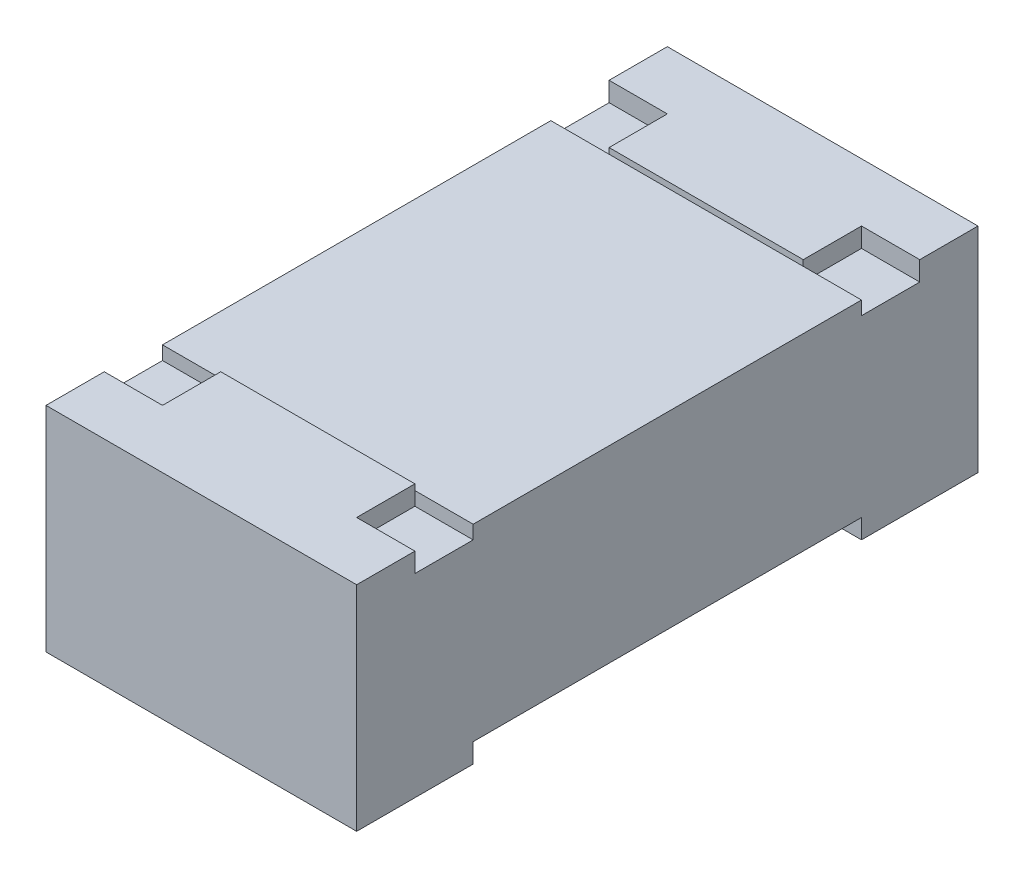
ISO-10303-21;
HEADER;
FILE_DESCRIPTION(('STEP AP214'),'2;1');
FILE_NAME('part.step','',(''),(''),'','','');
FILE_SCHEMA(('AUTOMOTIVE_DESIGN { 1 0 10303 214 1 1 1 1 }'));
ENDSEC;
DATA;
#1=APPLICATION_CONTEXT('core data for automotive mechanical design processes');
#2=APPLICATION_PROTOCOL_DEFINITION('international standard','automotive_design',2000,#1);
#3=PRODUCT_CONTEXT('',#1,'mechanical');
#4=PRODUCT('Part','Part','',(#3));
#5=PRODUCT_RELATED_PRODUCT_CATEGORY('part','',(#4));
#6=PRODUCT_DEFINITION_FORMATION('','',#4);
#7=PRODUCT_DEFINITION_CONTEXT('part definition',#1,'design');
#8=PRODUCT_DEFINITION('design','',#6,#7);
#9=PRODUCT_DEFINITION_SHAPE('','',#8);
#10=(LENGTH_UNIT() NAMED_UNIT(*) SI_UNIT(.MILLI.,.METRE.));
#11=(NAMED_UNIT(*) PLANE_ANGLE_UNIT() SI_UNIT($,.RADIAN.));
#12=(NAMED_UNIT(*) SI_UNIT($,.STERADIAN.) SOLID_ANGLE_UNIT());
#13=UNCERTAINTY_MEASURE_WITH_UNIT(LENGTH_MEASURE(1.E-05),#10,'distance_accuracy_value','');
#14=(GEOMETRIC_REPRESENTATION_CONTEXT(3) GLOBAL_UNCERTAINTY_ASSIGNED_CONTEXT((#13)) GLOBAL_UNIT_ASSIGNED_CONTEXT((#10,
#11,#12)) REPRESENTATION_CONTEXT('',''));
#15=CARTESIAN_POINT('',(0.,0.,0.));
#16=DIRECTION('',(0.,0.,1.));
#17=DIRECTION('',(1.,0.,0.));
#18=AXIS2_PLACEMENT_3D('',#15,#16,#17);
#19=CARTESIAN_POINT('',(-6.58499803303085,1.58166,-14.44));
#20=DIRECTION('',(0.,-1.,0.));
#21=DIRECTION('',(0.,0.,-1.));
#22=AXIS2_PLACEMENT_3D('',#19,#20,#21);
#23=PLANE('',#22);
#24=DIRECTION('',(-1.,0.,0.));
#25=VECTOR('',#24,1.);
#26=CARTESIAN_POINT('',(-6.58499803303084,1.58166,-14.74));
#27=LINE('',#26,#25);
#28=CARTESIAN_POINT('',(-6.58499803303084,1.58166,-14.74));
#29=VERTEX_POINT('',#28);
#30=CARTESIAN_POINT('',(-7.38499803303085,1.58166,-14.74));
#31=VERTEX_POINT('',#30);
#32=EDGE_CURVE('E19',#29,#31,#27,.T.);
#33=ORIENTED_EDGE('',*,*,#32,.F.);
#34=DIRECTION('',(0.,0.,-1.));
#35=VECTOR('',#34,1.);
#36=CARTESIAN_POINT('',(-6.58499803303084,1.58166,-14.74));
#37=LINE('',#36,#35);
#38=CARTESIAN_POINT('',(-6.58499803303085,1.58166,-14.44));
#39=VERTEX_POINT('',#38);
#40=EDGE_CURVE('E295',#39,#29,#37,.T.);
#41=ORIENTED_EDGE('',*,*,#40,.F.);
#42=DIRECTION('',(1.,0.,0.));
#43=VECTOR('',#42,1.);
#44=CARTESIAN_POINT('',(-6.58499803303085,1.58166,-14.44));
#45=LINE('',#44,#43);
#46=CARTESIAN_POINT('',(-7.38499803303085,1.58166,-14.44));
#47=VERTEX_POINT('',#46);
#48=EDGE_CURVE('E305',#47,#39,#45,.T.);
#49=ORIENTED_EDGE('',*,*,#48,.F.);
#50=DIRECTION('',(0.,0.,-1.));
#51=VECTOR('',#50,1.);
#52=CARTESIAN_POINT('',(-7.38499803303085,1.58166,-14.74));
#53=LINE('',#52,#51);
#54=EDGE_CURVE('E231',#47,#31,#53,.T.);
#55=ORIENTED_EDGE('',*,*,#54,.T.);
#56=EDGE_LOOP('',(#33,#41,#49,#55));
#57=FACE_BOUND('',#56,.T.);
#58=ADVANCED_FACE('F16',(#57),#23,.T.);
#59=CARTESIAN_POINT('',(-6.58499803303084,1.58166,-14.74));
#60=DIRECTION('',(0.,0.,-1.));
#61=DIRECTION('',(-1.,0.,0.));
#62=AXIS2_PLACEMENT_3D('',#59,#60,#61);
#63=PLANE('',#62);
#64=DIRECTION('',(1.,0.,0.));
#65=VECTOR('',#64,1.);
#66=CARTESIAN_POINT('',(-6.58499803303084,1.63166,-14.74));
#67=LINE('',#66,#65);
#68=CARTESIAN_POINT('',(-6.58499803303084,1.63166,-14.74));
#69=VERTEX_POINT('',#68);
#70=CARTESIAN_POINT('',(-7.38499803303085,1.63166,-14.74));
#71=VERTEX_POINT('',#70);
#72=EDGE_CURVE('E247',#69,#71,#67,.F.);
#73=ORIENTED_EDGE('',*,*,#72,.F.);
#74=DIRECTION('',(0.,1.,0.));
#75=VECTOR('',#74,1.);
#76=CARTESIAN_POINT('',(-6.58499803303084,1.58166,-14.74));
#77=LINE('',#76,#75);
#78=EDGE_CURVE('E226',#29,#69,#77,.T.);
#79=ORIENTED_EDGE('',*,*,#78,.F.);
#80=ORIENTED_EDGE('',*,*,#32,.T.);
#81=DIRECTION('',(0.,1.,0.));
#82=VECTOR('',#81,1.);
#83=CARTESIAN_POINT('',(-7.38499803303085,1.58166,-14.74));
#84=LINE('',#83,#82);
#85=EDGE_CURVE('E223',#31,#71,#84,.T.);
#86=ORIENTED_EDGE('',*,*,#85,.T.);
#87=EDGE_LOOP('',(#73,#79,#80,#86));
#88=FACE_BOUND('',#87,.T.);
#89=ADVANCED_FACE('F222',(#88),#63,.T.);
#90=CARTESIAN_POINT('',(-6.58499803303084,1.58166,-16.04));
#91=DIRECTION('',(0.,-1.,0.));
#92=DIRECTION('',(0.,0.,-1.));
#93=AXIS2_PLACEMENT_3D('',#90,#91,#92);
#94=PLANE('',#93);
#95=DIRECTION('',(-1.,0.,0.));
#96=VECTOR('',#95,1.);
#97=CARTESIAN_POINT('',(-6.58499803303084,1.58166,-16.04));
#98=LINE('',#97,#96);
#99=CARTESIAN_POINT('',(-6.58499803303084,1.58166,-16.04));
#100=VERTEX_POINT('',#99);
#101=CARTESIAN_POINT('',(-7.38499803303084,1.58166,-16.04));
#102=VERTEX_POINT('',#101);
#103=EDGE_CURVE('E192',#100,#102,#98,.T.);
#104=ORIENTED_EDGE('',*,*,#103,.F.);
#105=DIRECTION('',(0.,0.,1.));
#106=VECTOR('',#105,1.);
#107=CARTESIAN_POINT('',(-6.58499803303084,1.58166,-15.74));
#108=LINE('',#107,#106);
#109=CARTESIAN_POINT('',(-6.58499803303084,1.58166,-15.74));
#110=VERTEX_POINT('',#109);
#111=EDGE_CURVE('E291',#100,#110,#108,.T.);
#112=ORIENTED_EDGE('',*,*,#111,.T.);
#113=DIRECTION('',(1.,0.,0.));
#114=VECTOR('',#113,1.);
#115=CARTESIAN_POINT('',(-6.58499803303084,1.58166,-15.74));
#116=LINE('',#115,#114);
#117=CARTESIAN_POINT('',(-7.38499803303085,1.58166,-15.74));
#118=VERTEX_POINT('',#117);
#119=EDGE_CURVE('E187',#118,#110,#116,.T.);
#120=ORIENTED_EDGE('',*,*,#119,.F.);
#121=DIRECTION('',(0.,0.,1.));
#122=VECTOR('',#121,1.);
#123=CARTESIAN_POINT('',(-7.38499803303085,1.58166,-15.74));
#124=LINE('',#123,#122);
#125=EDGE_CURVE('E203',#102,#118,#124,.T.);
#126=ORIENTED_EDGE('',*,*,#125,.F.);
#127=EDGE_LOOP('',(#104,#112,#120,#126));
#128=FACE_BOUND('',#127,.T.);
#129=ADVANCED_FACE('F204',(#128),#94,.T.);
#130=CARTESIAN_POINT('',(-6.58499803303084,1.58166,-15.74));
#131=DIRECTION('',(0.,0.,1.));
#132=DIRECTION('',(1.,0.,0.));
#133=AXIS2_PLACEMENT_3D('',#130,#131,#132);
#134=PLANE('',#133);
#135=ORIENTED_EDGE('',*,*,#119,.T.);
#136=DIRECTION('',(0.,1.,0.));
#137=VECTOR('',#136,1.);
#138=CARTESIAN_POINT('',(-6.58499803303084,2.08166,-15.74));
#139=LINE('',#138,#137);
#140=CARTESIAN_POINT('',(-6.58499803303084,1.63166,-15.74));
#141=VERTEX_POINT('',#140);
#142=EDGE_CURVE('E289',#110,#141,#139,.T.);
#143=ORIENTED_EDGE('',*,*,#142,.T.);
#144=DIRECTION('',(1.,0.,0.));
#145=VECTOR('',#144,1.);
#146=CARTESIAN_POINT('',(-6.58499803303084,1.63166,-15.74));
#147=LINE('',#146,#145);
#148=CARTESIAN_POINT('',(-7.38499803303085,1.63166,-15.74));
#149=VERTEX_POINT('',#148);
#150=EDGE_CURVE('E245',#149,#141,#147,.T.);
#151=ORIENTED_EDGE('',*,*,#150,.F.);
#152=DIRECTION('',(0.,1.,0.));
#153=VECTOR('',#152,1.);
#154=CARTESIAN_POINT('',(-7.38499803303085,2.08166,-15.74));
#155=LINE('',#154,#153);
#156=EDGE_CURVE('E207',#118,#149,#155,.T.);
#157=ORIENTED_EDGE('',*,*,#156,.F.);
#158=EDGE_LOOP('',(#135,#143,#151,#157));
#159=FACE_BOUND('',#158,.T.);
#160=ADVANCED_FACE('F489',(#159),#134,.T.);
#161=CARTESIAN_POINT('',(-6.58499803303084,2.08166,-15.89));
#162=DIRECTION('',(0.,0.,-1.));
#163=DIRECTION('',(-1.,0.,0.));
#164=AXIS2_PLACEMENT_3D('',#161,#162,#163);
#165=PLANE('',#164);
#166=DIRECTION('',(0.,1.,0.));
#167=VECTOR('',#166,1.);
#168=CARTESIAN_POINT('',(-6.73499803303084,2.08166,-15.89));
#169=LINE('',#168,#167);
#170=CARTESIAN_POINT('',(-6.73499803303084,2.13166,-15.89));
#171=VERTEX_POINT('',#170);
#172=CARTESIAN_POINT('',(-6.73499803303084,2.08166,-15.89));
#173=VERTEX_POINT('',#172);
#174=EDGE_CURVE('E282',#171,#173,#169,.F.);
#175=ORIENTED_EDGE('',*,*,#174,.T.);
#176=DIRECTION('',(1.,0.,0.));
#177=VECTOR('',#176,1.);
#178=CARTESIAN_POINT('',(-6.58499803303084,2.08166,-15.89));
#179=LINE('',#178,#177);
#180=CARTESIAN_POINT('',(-6.58499803303084,2.08166,-15.89));
#181=VERTEX_POINT('',#180);
#182=EDGE_CURVE('E284',#181,#173,#179,.F.);
#183=ORIENTED_EDGE('',*,*,#182,.F.);
#184=DIRECTION('',(0.,1.,0.));
#185=VECTOR('',#184,1.);
#186=CARTESIAN_POINT('',(-6.58499803303084,2.08166,-15.89));
#187=LINE('',#186,#185);
#188=CARTESIAN_POINT('',(-6.58499803303084,2.13166,-15.89));
#189=VERTEX_POINT('',#188);
#190=EDGE_CURVE('E287',#181,#189,#187,.T.);
#191=ORIENTED_EDGE('',*,*,#190,.T.);
#192=DIRECTION('',(1.,0.,0.));
#193=VECTOR('',#192,1.);
#194=CARTESIAN_POINT('',(-6.58499803303084,2.13166,-15.89));
#195=LINE('',#194,#193);
#196=EDGE_CURVE('E274',#171,#189,#195,.T.);
#197=ORIENTED_EDGE('',*,*,#196,.F.);
#198=EDGE_LOOP('',(#175,#183,#191,#197));
#199=FACE_BOUND('',#198,.T.);
#200=ADVANCED_FACE('F491',(#199),#165,.F.);
#201=CARTESIAN_POINT('',(-6.58499803303084,2.13166,-16.04));
#202=DIRECTION('',(0.,0.,-1.));
#203=DIRECTION('',(-1.,0.,0.));
#204=AXIS2_PLACEMENT_3D('',#201,#202,#203);
#205=PLANE('',#204);
#206=DIRECTION('',(1.,0.,0.));
#207=VECTOR('',#206,1.);
#208=CARTESIAN_POINT('',(-6.58499803303084,2.13166,-16.04));
#209=LINE('',#208,#207);
#210=CARTESIAN_POINT('',(-6.58499803303084,2.13166,-16.04));
#211=VERTEX_POINT('',#210);
#212=CARTESIAN_POINT('',(-7.38499803303084,2.13166,-16.04));
#213=VERTEX_POINT('',#212);
#214=EDGE_CURVE('E269',#211,#213,#209,.F.);
#215=ORIENTED_EDGE('',*,*,#214,.F.);
#216=DIRECTION('',(0.,1.,0.));
#217=VECTOR('',#216,1.);
#218=CARTESIAN_POINT('',(-6.58499803303084,2.08166,-16.04));
#219=LINE('',#218,#217);
#220=EDGE_CURVE('E198',#211,#100,#219,.F.);
#221=ORIENTED_EDGE('',*,*,#220,.T.);
#222=ORIENTED_EDGE('',*,*,#103,.T.);
#223=DIRECTION('',(0.,1.,0.));
#224=VECTOR('',#223,1.);
#225=CARTESIAN_POINT('',(-7.38499803303085,2.08166,-16.04));
#226=LINE('',#225,#224);
#227=EDGE_CURVE('E196',#213,#102,#226,.F.);
#228=ORIENTED_EDGE('',*,*,#227,.F.);
#229=EDGE_LOOP('',(#215,#221,#222,#228));
#230=FACE_BOUND('',#229,.T.);
#231=ADVANCED_FACE('F194',(#230),#205,.T.);
#232=CARTESIAN_POINT('',(-7.38499803303084,2.08166,-15.89));
#233=DIRECTION('',(0.,0.,-1.));
#234=DIRECTION('',(-1.,0.,0.));
#235=AXIS2_PLACEMENT_3D('',#232,#233,#234);
#236=PLANE('',#235);
#237=DIRECTION('',(0.,1.,0.));
#238=VECTOR('',#237,1.);
#239=CARTESIAN_POINT('',(-7.38499803303085,2.08166,-15.89));
#240=LINE('',#239,#238);
#241=CARTESIAN_POINT('',(-7.38499803303084,2.08166,-15.89));
#242=VERTEX_POINT('',#241);
#243=CARTESIAN_POINT('',(-7.38499803303084,2.13166,-15.89));
#244=VERTEX_POINT('',#243);
#245=EDGE_CURVE('E200',#242,#244,#240,.T.);
#246=ORIENTED_EDGE('',*,*,#245,.F.);
#247=DIRECTION('',(1.,0.,0.));
#248=VECTOR('',#247,1.);
#249=CARTESIAN_POINT('',(-6.58499803303084,2.08166,-15.89));
#250=LINE('',#249,#248);
#251=CARTESIAN_POINT('',(-7.23499803303084,2.08166,-15.89));
#252=VERTEX_POINT('',#251);
#253=EDGE_CURVE('E249',#252,#242,#250,.F.);
#254=ORIENTED_EDGE('',*,*,#253,.F.);
#255=DIRECTION('',(0.,1.,0.));
#256=VECTOR('',#255,1.);
#257=CARTESIAN_POINT('',(-7.23499803303084,2.08166,-15.89));
#258=LINE('',#257,#256);
#259=CARTESIAN_POINT('',(-7.23499803303084,2.13166,-15.89));
#260=VERTEX_POINT('',#259);
#261=EDGE_CURVE('E263',#252,#260,#258,.T.);
#262=ORIENTED_EDGE('',*,*,#261,.T.);
#263=DIRECTION('',(1.,0.,0.));
#264=VECTOR('',#263,1.);
#265=CARTESIAN_POINT('',(-6.58499803303084,2.13166,-15.89));
#266=LINE('',#265,#264);
#267=EDGE_CURVE('E265',#244,#260,#266,.T.);
#268=ORIENTED_EDGE('',*,*,#267,.F.);
#269=EDGE_LOOP('',(#246,#254,#262,#268));
#270=FACE_BOUND('',#269,.T.);
#271=ADVANCED_FACE('F483',(#270),#236,.F.);
#272=CARTESIAN_POINT('',(-7.38499803303085,2.08166,-14.59));
#273=DIRECTION('',(0.,0.,1.));
#274=DIRECTION('',(1.,0.,0.));
#275=AXIS2_PLACEMENT_3D('',#272,#273,#274);
#276=PLANE('',#275);
#277=DIRECTION('',(0.,1.,0.));
#278=VECTOR('',#277,1.);
#279=CARTESIAN_POINT('',(-7.23499803303084,2.08166,-14.59));
#280=LINE('',#279,#278);
#281=CARTESIAN_POINT('',(-7.23499803303085,2.13166,-14.59));
#282=VERTEX_POINT('',#281);
#283=CARTESIAN_POINT('',(-7.23499803303085,2.08166,-14.59));
#284=VERTEX_POINT('',#283);
#285=EDGE_CURVE('E335',#282,#284,#280,.F.);
#286=ORIENTED_EDGE('',*,*,#285,.T.);
#287=DIRECTION('',(1.,0.,0.));
#288=VECTOR('',#287,1.);
#289=CARTESIAN_POINT('',(-6.58499803303084,2.08166,-14.59));
#290=LINE('',#289,#288);
#291=CARTESIAN_POINT('',(-7.38499803303085,2.08166,-14.59));
#292=VERTEX_POINT('',#291);
#293=EDGE_CURVE('E252',#292,#284,#290,.T.);
#294=ORIENTED_EDGE('',*,*,#293,.F.);
#295=DIRECTION('',(0.,1.,0.));
#296=VECTOR('',#295,1.);
#297=CARTESIAN_POINT('',(-7.38499803303085,1.58166,-14.59));
#298=LINE('',#297,#296);
#299=CARTESIAN_POINT('',(-7.38499803303085,2.13166,-14.59));
#300=VERTEX_POINT('',#299);
#301=EDGE_CURVE('E235',#292,#300,#298,.T.);
#302=ORIENTED_EDGE('',*,*,#301,.T.);
#303=DIRECTION('',(1.,0.,0.));
#304=VECTOR('',#303,1.);
#305=CARTESIAN_POINT('',(-6.58499803303084,2.13166,-14.59));
#306=LINE('',#305,#304);
#307=EDGE_CURVE('E318',#282,#300,#306,.F.);
#308=ORIENTED_EDGE('',*,*,#307,.F.);
#309=EDGE_LOOP('',(#286,#294,#302,#308));
#310=FACE_BOUND('',#309,.T.);
#311=ADVANCED_FACE('F553',(#310),#276,.F.);
#312=CARTESIAN_POINT('',(-6.58499803303085,2.13166,-14.44));
#313=DIRECTION('',(0.,0.,1.));
#314=DIRECTION('',(1.,0.,0.));
#315=AXIS2_PLACEMENT_3D('',#312,#313,#314);
#316=PLANE('',#315);
#317=ORIENTED_EDGE('',*,*,#48,.T.);
#318=DIRECTION('',(0.,1.,0.));
#319=VECTOR('',#318,1.);
#320=CARTESIAN_POINT('',(-6.58499803303084,1.58166,-14.44));
#321=LINE('',#320,#319);
#322=CARTESIAN_POINT('',(-6.58499803303085,2.13166,-14.44));
#323=VERTEX_POINT('',#322);
#324=EDGE_CURVE('E297',#323,#39,#321,.F.);
#325=ORIENTED_EDGE('',*,*,#324,.F.);
#326=DIRECTION('',(1.,0.,0.));
#327=VECTOR('',#326,1.);
#328=CARTESIAN_POINT('',(-6.58499803303084,2.13166,-14.44));
#329=LINE('',#328,#327);
#330=CARTESIAN_POINT('',(-7.38499803303085,2.13166,-14.44));
#331=VERTEX_POINT('',#330);
#332=EDGE_CURVE('E311',#331,#323,#329,.T.);
#333=ORIENTED_EDGE('',*,*,#332,.F.);
#334=DIRECTION('',(0.,1.,0.));
#335=VECTOR('',#334,1.);
#336=CARTESIAN_POINT('',(-7.38499803303085,2.13166,-14.44));
#337=LINE('',#336,#335);
#338=EDGE_CURVE('E237',#331,#47,#337,.F.);
#339=ORIENTED_EDGE('',*,*,#338,.T.);
#340=EDGE_LOOP('',(#317,#325,#333,#339));
#341=FACE_BOUND('',#340,.T.);
#342=ADVANCED_FACE('F309',(#341),#316,.T.);
#343=CARTESIAN_POINT('',(-6.58499803303085,2.08166,-14.59));
#344=DIRECTION('',(0.,0.,1.));
#345=DIRECTION('',(1.,0.,0.));
#346=AXIS2_PLACEMENT_3D('',#343,#344,#345);
#347=PLANE('',#346);
#348=DIRECTION('',(0.,1.,0.));
#349=VECTOR('',#348,1.);
#350=CARTESIAN_POINT('',(-6.58499803303084,1.58166,-14.59));
#351=LINE('',#350,#349);
#352=CARTESIAN_POINT('',(-6.58499803303085,2.08166,-14.59));
#353=VERTEX_POINT('',#352);
#354=CARTESIAN_POINT('',(-6.58499803303085,2.13166,-14.59));
#355=VERTEX_POINT('',#354);
#356=EDGE_CURVE('E300',#353,#355,#351,.T.);
#357=ORIENTED_EDGE('',*,*,#356,.F.);
#358=DIRECTION('',(1.,0.,0.));
#359=VECTOR('',#358,1.);
#360=CARTESIAN_POINT('',(-6.58499803303084,2.08166,-14.59));
#361=LINE('',#360,#359);
#362=CARTESIAN_POINT('',(-6.73499803303085,2.08166,-14.59));
#363=VERTEX_POINT('',#362);
#364=EDGE_CURVE('E400',#363,#353,#361,.T.);
#365=ORIENTED_EDGE('',*,*,#364,.F.);
#366=DIRECTION('',(0.,1.,0.));
#367=VECTOR('',#366,1.);
#368=CARTESIAN_POINT('',(-6.73499803303084,2.08166,-14.59));
#369=LINE('',#368,#367);
#370=CARTESIAN_POINT('',(-6.73499803303085,2.13166,-14.59));
#371=VERTEX_POINT('',#370);
#372=EDGE_CURVE('E405',#363,#371,#369,.T.);
#373=ORIENTED_EDGE('',*,*,#372,.T.);
#374=DIRECTION('',(1.,0.,0.));
#375=VECTOR('',#374,1.);
#376=CARTESIAN_POINT('',(-6.58499803303084,2.13166,-14.59));
#377=LINE('',#376,#375);
#378=EDGE_CURVE('E327',#355,#371,#377,.F.);
#379=ORIENTED_EDGE('',*,*,#378,.F.);
#380=EDGE_LOOP('',(#357,#365,#373,#379));
#381=FACE_BOUND('',#380,.T.);
#382=ADVANCED_FACE('F415',(#381),#347,.F.);
#383=CARTESIAN_POINT('',(-6.58499803303084,1.63166,-15.99));
#384=DIRECTION('',(0.,-1.,0.));
#385=DIRECTION('',(0.,0.,-1.));
#386=AXIS2_PLACEMENT_3D('',#383,#384,#385);
#387=PLANE('',#386);
#388=ORIENTED_EDGE('',*,*,#150,.T.);
#389=DIRECTION('',(0.,0.,1.));
#390=VECTOR('',#389,1.);
#391=CARTESIAN_POINT('',(-6.58499803303084,1.63166,-15.99));
#392=LINE('',#391,#390);
#393=EDGE_CURVE('E395',#141,#69,#392,.T.);
#394=ORIENTED_EDGE('',*,*,#393,.T.);
#395=ORIENTED_EDGE('',*,*,#72,.T.);
#396=DIRECTION('',(0.,0.,1.));
#397=VECTOR('',#396,1.);
#398=CARTESIAN_POINT('',(-7.38499803303084,1.63166,-15.99));
#399=LINE('',#398,#397);
#400=EDGE_CURVE('E234',#149,#71,#399,.T.);
#401=ORIENTED_EDGE('',*,*,#400,.F.);
#402=EDGE_LOOP('',(#388,#394,#395,#401));
#403=FACE_BOUND('',#402,.T.);
#404=ADVANCED_FACE('F243',(#403),#387,.T.);
#405=CARTESIAN_POINT('',(-6.58499803303084,2.08166,-15.99));
#406=DIRECTION('',(0.,1.,0.));
#407=DIRECTION('',(0.,0.,1.));
#408=AXIS2_PLACEMENT_3D('',#405,#406,#407);
#409=PLANE('',#408);
#410=DIRECTION('',(0.,0.,1.));
#411=VECTOR('',#410,1.);
#412=CARTESIAN_POINT('',(-6.58499803303084,2.08166,-15.99));
#413=LINE('',#412,#411);
#414=CARTESIAN_POINT('',(-6.58499803303084,2.08166,-15.74));
#415=VERTEX_POINT('',#414);
#416=EDGE_CURVE('E390',#415,#181,#413,.F.);
#417=ORIENTED_EDGE('',*,*,#416,.T.);
#418=ORIENTED_EDGE('',*,*,#182,.T.);
#419=DIRECTION('',(0.,0.,1.));
#420=VECTOR('',#419,1.);
#421=CARTESIAN_POINT('',(-6.73499803303084,2.08166,-15.89));
#422=LINE('',#421,#420);
#423=CARTESIAN_POINT('',(-6.73499803303084,2.08166,-15.74));
#424=VERTEX_POINT('',#423);
#425=EDGE_CURVE('E280',#173,#424,#422,.T.);
#426=ORIENTED_EDGE('',*,*,#425,.T.);
#427=DIRECTION('',(-1.,0.,0.));
#428=VECTOR('',#427,1.);
#429=CARTESIAN_POINT('',(-6.58499803303084,2.08166,-15.74));
#430=LINE('',#429,#428);
#431=EDGE_CURVE('E384',#415,#424,#430,.T.);
#432=ORIENTED_EDGE('',*,*,#431,.F.);
#433=EDGE_LOOP('',(#417,#418,#426,#432));
#434=FACE_BOUND('',#433,.T.);
#435=ADVANCED_FACE('F543',(#434),#409,.T.);
#436=CARTESIAN_POINT('',(-6.73499803303084,2.08166,-15.89));
#437=DIRECTION('',(-1.,0.,0.));
#438=DIRECTION('',(0.,0.,1.));
#439=AXIS2_PLACEMENT_3D('',#436,#437,#438);
#440=PLANE('',#439);
#441=DIRECTION('',(0.,1.,0.));
#442=VECTOR('',#441,1.);
#443=CARTESIAN_POINT('',(-6.73499803303084,2.11666,-15.74));
#444=LINE('',#443,#442);
#445=CARTESIAN_POINT('',(-6.73499803303084,2.11666,-15.74));
#446=VERTEX_POINT('',#445);
#447=EDGE_CURVE('E387',#424,#446,#444,.T.);
#448=ORIENTED_EDGE('',*,*,#447,.F.);
#449=ORIENTED_EDGE('',*,*,#425,.F.);
#450=ORIENTED_EDGE('',*,*,#174,.F.);
#451=DIRECTION('',(0.,0.,1.));
#452=VECTOR('',#451,1.);
#453=CARTESIAN_POINT('',(-6.73499803303084,2.13166,-15.74));
#454=LINE('',#453,#452);
#455=CARTESIAN_POINT('',(-6.73499803303084,2.13166,-15.74));
#456=VERTEX_POINT('',#455);
#457=EDGE_CURVE('E277',#456,#171,#454,.F.);
#458=ORIENTED_EDGE('',*,*,#457,.F.);
#459=DIRECTION('',(0.,1.,0.));
#460=VECTOR('',#459,1.);
#461=CARTESIAN_POINT('',(-6.73499803303084,2.13166,-15.74));
#462=LINE('',#461,#460);
#463=EDGE_CURVE('E381',#446,#456,#462,.T.);
#464=ORIENTED_EDGE('',*,*,#463,.F.);
#465=EDGE_LOOP('',(#448,#449,#450,#458,#464));
#466=FACE_BOUND('',#465,.T.);
#467=ADVANCED_FACE('F540',(#466),#440,.F.);
#468=CARTESIAN_POINT('',(-6.58499803303084,2.13166,-15.74));
#469=DIRECTION('',(0.,1.,0.));
#470=DIRECTION('',(0.,0.,1.));
#471=AXIS2_PLACEMENT_3D('',#468,#469,#470);
#472=PLANE('',#471);
#473=DIRECTION('',(0.,0.,-1.));
#474=VECTOR('',#473,1.);
#475=CARTESIAN_POINT('',(-7.23499803303084,2.13166,-15.89));
#476=LINE('',#475,#474);
#477=CARTESIAN_POINT('',(-7.23499803303084,2.13166,-15.74));
#478=VERTEX_POINT('',#477);
#479=EDGE_CURVE('E261',#260,#478,#476,.F.);
#480=ORIENTED_EDGE('',*,*,#479,.T.);
#481=DIRECTION('',(1.,0.,0.));
#482=VECTOR('',#481,1.);
#483=CARTESIAN_POINT('',(-6.58499803303084,2.13166,-15.74));
#484=LINE('',#483,#482);
#485=EDGE_CURVE('E378',#456,#478,#484,.F.);
#486=ORIENTED_EDGE('',*,*,#485,.F.);
#487=ORIENTED_EDGE('',*,*,#457,.T.);
#488=ORIENTED_EDGE('',*,*,#196,.T.);
#489=DIRECTION('',(0.,0.,1.));
#490=VECTOR('',#489,1.);
#491=CARTESIAN_POINT('',(-6.58499803303084,2.13166,-15.74));
#492=LINE('',#491,#490);
#493=EDGE_CURVE('E271',#189,#211,#492,.F.);
#494=ORIENTED_EDGE('',*,*,#493,.T.);
#495=ORIENTED_EDGE('',*,*,#214,.T.);
#496=DIRECTION('',(0.,0.,1.));
#497=VECTOR('',#496,1.);
#498=CARTESIAN_POINT('',(-7.38499803303084,2.13166,-15.74));
#499=LINE('',#498,#497);
#500=EDGE_CURVE('E211',#213,#244,#499,.T.);
#501=ORIENTED_EDGE('',*,*,#500,.T.);
#502=ORIENTED_EDGE('',*,*,#267,.T.);
#503=EDGE_LOOP('',(#480,#486,#487,#488,#494,#495,#501,#502));
#504=FACE_BOUND('',#503,.T.);
#505=ADVANCED_FACE('F486',(#504),#472,.T.);
#506=CARTESIAN_POINT('',(-7.23499803303084,2.08166,-15.89));
#507=DIRECTION('',(1.,0.,0.));
#508=DIRECTION('',(0.,0.,-1.));
#509=AXIS2_PLACEMENT_3D('',#506,#507,#508);
#510=PLANE('',#509);
#511=DIRECTION('',(0.,1.,0.));
#512=VECTOR('',#511,1.);
#513=CARTESIAN_POINT('',(-7.23499803303084,2.13166,-15.74));
#514=LINE('',#513,#512);
#515=CARTESIAN_POINT('',(-7.23499803303084,2.11666,-15.74));
#516=VERTEX_POINT('',#515);
#517=EDGE_CURVE('E375',#478,#516,#514,.F.);
#518=ORIENTED_EDGE('',*,*,#517,.F.);
#519=ORIENTED_EDGE('',*,*,#479,.F.);
#520=ORIENTED_EDGE('',*,*,#261,.F.);
#521=DIRECTION('',(0.,0.,1.));
#522=VECTOR('',#521,1.);
#523=CARTESIAN_POINT('',(-7.23499803303084,2.08166,-15.99));
#524=LINE('',#523,#522);
#525=CARTESIAN_POINT('',(-7.23499803303084,2.08166,-15.74));
#526=VERTEX_POINT('',#525);
#527=EDGE_CURVE('E255',#526,#252,#524,.F.);
#528=ORIENTED_EDGE('',*,*,#527,.F.);
#529=DIRECTION('',(0.,1.,0.));
#530=VECTOR('',#529,1.);
#531=CARTESIAN_POINT('',(-7.23499803303084,2.11666,-15.74));
#532=LINE('',#531,#530);
#533=EDGE_CURVE('E372',#516,#526,#532,.F.);
#534=ORIENTED_EDGE('',*,*,#533,.F.);
#535=EDGE_LOOP('',(#518,#519,#520,#528,#534));
#536=FACE_BOUND('',#535,.T.);
#537=ADVANCED_FACE('F534',(#536),#510,.F.);
#538=CARTESIAN_POINT('',(-6.58499803303084,2.08166,-15.99));
#539=DIRECTION('',(0.,1.,0.));
#540=DIRECTION('',(0.,0.,1.));
#541=AXIS2_PLACEMENT_3D('',#538,#539,#540);
#542=PLANE('',#541);
#543=DIRECTION('',(0.,0.,1.));
#544=VECTOR('',#543,1.);
#545=CARTESIAN_POINT('',(-7.38499803303084,2.08166,-15.99));
#546=LINE('',#545,#544);
#547=CARTESIAN_POINT('',(-7.38499803303084,2.08166,-15.74));
#548=VERTEX_POINT('',#547);
#549=EDGE_CURVE('E248',#548,#242,#546,.F.);
#550=ORIENTED_EDGE('',*,*,#549,.F.);
#551=DIRECTION('',(-1.,0.,0.));
#552=VECTOR('',#551,1.);
#553=CARTESIAN_POINT('',(-6.58499803303084,2.08166,-15.74));
#554=LINE('',#553,#552);
#555=EDGE_CURVE('E369',#526,#548,#554,.T.);
#556=ORIENTED_EDGE('',*,*,#555,.F.);
#557=ORIENTED_EDGE('',*,*,#527,.T.);
#558=ORIENTED_EDGE('',*,*,#253,.T.);
#559=EDGE_LOOP('',(#550,#556,#557,#558));
#560=FACE_BOUND('',#559,.T.);
#561=ADVANCED_FACE('F480',(#560),#542,.T.);
#562=CARTESIAN_POINT('',(-6.58499803303084,2.08166,-15.99));
#563=DIRECTION('',(0.,1.,0.));
#564=DIRECTION('',(0.,0.,1.));
#565=AXIS2_PLACEMENT_3D('',#562,#563,#564);
#566=PLANE('',#565);
#567=DIRECTION('',(1.,0.,0.));
#568=VECTOR('',#567,1.);
#569=CARTESIAN_POINT('',(-6.58499803303084,2.08166,-14.74));
#570=LINE('',#569,#568);
#571=CARTESIAN_POINT('',(-7.38499803303085,2.08166,-14.74));
#572=VERTEX_POINT('',#571);
#573=CARTESIAN_POINT('',(-7.23499803303085,2.08166,-14.74));
#574=VERTEX_POINT('',#573);
#575=EDGE_CURVE('E359',#572,#574,#570,.T.);
#576=ORIENTED_EDGE('',*,*,#575,.F.);
#577=DIRECTION('',(0.,0.,1.));
#578=VECTOR('',#577,1.);
#579=CARTESIAN_POINT('',(-7.38499803303085,2.08166,-15.99));
#580=LINE('',#579,#578);
#581=EDGE_CURVE('E337',#572,#292,#580,.T.);
#582=ORIENTED_EDGE('',*,*,#581,.T.);
#583=ORIENTED_EDGE('',*,*,#293,.T.);
#584=DIRECTION('',(0.,0.,-1.));
#585=VECTOR('',#584,1.);
#586=CARTESIAN_POINT('',(-7.23499803303084,2.08166,-15.89));
#587=LINE('',#586,#585);
#588=EDGE_CURVE('E333',#284,#574,#587,.T.);
#589=ORIENTED_EDGE('',*,*,#588,.T.);
#590=EDGE_LOOP('',(#576,#582,#583,#589));
#591=FACE_BOUND('',#590,.T.);
#592=ADVANCED_FACE('F343',(#591),#566,.T.);
#593=CARTESIAN_POINT('',(-7.23499803303084,2.08166,-15.89));
#594=DIRECTION('',(1.,0.,0.));
#595=DIRECTION('',(0.,0.,-1.));
#596=AXIS2_PLACEMENT_3D('',#593,#594,#595);
#597=PLANE('',#596);
#598=DIRECTION('',(0.,1.,0.));
#599=VECTOR('',#598,1.);
#600=CARTESIAN_POINT('',(-7.23499803303085,2.11666,-14.74));
#601=LINE('',#600,#599);
#602=CARTESIAN_POINT('',(-7.23499803303085,2.11666,-14.74));
#603=VERTEX_POINT('',#602);
#604=EDGE_CURVE('E348',#574,#603,#601,.T.);
#605=ORIENTED_EDGE('',*,*,#604,.F.);
#606=ORIENTED_EDGE('',*,*,#588,.F.);
#607=ORIENTED_EDGE('',*,*,#285,.F.);
#608=DIRECTION('',(0.,0.,1.));
#609=VECTOR('',#608,1.);
#610=CARTESIAN_POINT('',(-7.23499803303085,2.13166,-14.74));
#611=LINE('',#610,#609);
#612=CARTESIAN_POINT('',(-7.23499803303085,2.13166,-14.74));
#613=VERTEX_POINT('',#612);
#614=EDGE_CURVE('E324',#613,#282,#611,.T.);
#615=ORIENTED_EDGE('',*,*,#614,.F.);
#616=DIRECTION('',(0.,1.,0.));
#617=VECTOR('',#616,1.);
#618=CARTESIAN_POINT('',(-7.23499803303085,2.13166,-14.74));
#619=LINE('',#618,#617);
#620=EDGE_CURVE('E351',#603,#613,#619,.T.);
#621=ORIENTED_EDGE('',*,*,#620,.F.);
#622=EDGE_LOOP('',(#605,#606,#607,#615,#621));
#623=FACE_BOUND('',#622,.T.);
#624=ADVANCED_FACE('F346',(#623),#597,.F.);
#625=CARTESIAN_POINT('',(-6.58499803303084,2.13166,-14.74));
#626=DIRECTION('',(0.,1.,0.));
#627=DIRECTION('',(0.,0.,1.));
#628=AXIS2_PLACEMENT_3D('',#625,#626,#627);
#629=PLANE('',#628);
#630=ORIENTED_EDGE('',*,*,#332,.T.);
#631=DIRECTION('',(0.,0.,1.));
#632=VECTOR('',#631,1.);
#633=CARTESIAN_POINT('',(-6.58499803303085,2.13166,-14.74));
#634=LINE('',#633,#632);
#635=EDGE_CURVE('E407',#323,#355,#634,.F.);
#636=ORIENTED_EDGE('',*,*,#635,.T.);
#637=ORIENTED_EDGE('',*,*,#378,.T.);
#638=DIRECTION('',(0.,0.,1.));
#639=VECTOR('',#638,1.);
#640=CARTESIAN_POINT('',(-6.73499803303084,2.13166,-15.89));
#641=LINE('',#640,#639);
#642=CARTESIAN_POINT('',(-6.73499803303085,2.13166,-14.74));
#643=VERTEX_POINT('',#642);
#644=EDGE_CURVE('E403',#371,#643,#641,.F.);
#645=ORIENTED_EDGE('',*,*,#644,.T.);
#646=DIRECTION('',(-1.,0.,0.));
#647=VECTOR('',#646,1.);
#648=CARTESIAN_POINT('',(-6.58499803303084,2.13166,-14.74));
#649=LINE('',#648,#647);
#650=EDGE_CURVE('E362',#613,#643,#649,.F.);
#651=ORIENTED_EDGE('',*,*,#650,.F.);
#652=ORIENTED_EDGE('',*,*,#614,.T.);
#653=ORIENTED_EDGE('',*,*,#307,.T.);
#654=DIRECTION('',(0.,0.,1.));
#655=VECTOR('',#654,1.);
#656=CARTESIAN_POINT('',(-7.38499803303085,2.13166,-14.74));
#657=LINE('',#656,#655);
#658=EDGE_CURVE('E314',#300,#331,#657,.T.);
#659=ORIENTED_EDGE('',*,*,#658,.T.);
#660=EDGE_LOOP('',(#630,#636,#637,#645,#651,#652,#653,#659));
#661=FACE_BOUND('',#660,.T.);
#662=ADVANCED_FACE('F322',(#661),#629,.T.);
#663=CARTESIAN_POINT('',(-6.73499803303084,2.08166,-15.89));
#664=DIRECTION('',(-1.,0.,0.));
#665=DIRECTION('',(0.,0.,1.));
#666=AXIS2_PLACEMENT_3D('',#663,#664,#665);
#667=PLANE('',#666);
#668=DIRECTION('',(0.,1.,0.));
#669=VECTOR('',#668,1.);
#670=CARTESIAN_POINT('',(-6.73499803303085,2.13166,-14.74));
#671=LINE('',#670,#669);
#672=CARTESIAN_POINT('',(-6.73499803303085,2.11666,-14.74));
#673=VERTEX_POINT('',#672);
#674=EDGE_CURVE('E427',#643,#673,#671,.F.);
#675=ORIENTED_EDGE('',*,*,#674,.F.);
#676=ORIENTED_EDGE('',*,*,#644,.F.);
#677=ORIENTED_EDGE('',*,*,#372,.F.);
#678=DIRECTION('',(0.,0.,1.));
#679=VECTOR('',#678,1.);
#680=CARTESIAN_POINT('',(-6.73499803303085,2.08166,-15.99));
#681=LINE('',#680,#679);
#682=CARTESIAN_POINT('',(-6.73499803303085,2.08166,-14.74));
#683=VERTEX_POINT('',#682);
#684=EDGE_CURVE('E397',#683,#363,#681,.T.);
#685=ORIENTED_EDGE('',*,*,#684,.F.);
#686=DIRECTION('',(0.,1.,0.));
#687=VECTOR('',#686,1.);
#688=CARTESIAN_POINT('',(-6.73499803303085,2.11666,-14.74));
#689=LINE('',#688,#687);
#690=EDGE_CURVE('E425',#673,#683,#689,.F.);
#691=ORIENTED_EDGE('',*,*,#690,.F.);
#692=EDGE_LOOP('',(#675,#676,#677,#685,#691));
#693=FACE_BOUND('',#692,.T.);
#694=ADVANCED_FACE('F424',(#693),#667,.F.);
#695=CARTESIAN_POINT('',(-6.58499803303084,2.08166,-15.99));
#696=DIRECTION('',(0.,1.,0.));
#697=DIRECTION('',(0.,0.,1.));
#698=AXIS2_PLACEMENT_3D('',#695,#696,#697);
#699=PLANE('',#698);
#700=DIRECTION('',(1.,0.,0.));
#701=VECTOR('',#700,1.);
#702=CARTESIAN_POINT('',(-6.58499803303084,2.08166,-14.74));
#703=LINE('',#702,#701);
#704=CARTESIAN_POINT('',(-6.58499803303085,2.08166,-14.74));
#705=VERTEX_POINT('',#704);
#706=EDGE_CURVE('E420',#683,#705,#703,.T.);
#707=ORIENTED_EDGE('',*,*,#706,.F.);
#708=ORIENTED_EDGE('',*,*,#684,.T.);
#709=ORIENTED_EDGE('',*,*,#364,.T.);
#710=DIRECTION('',(0.,0.,1.));
#711=VECTOR('',#710,1.);
#712=CARTESIAN_POINT('',(-6.58499803303084,2.08166,-15.99));
#713=LINE('',#712,#711);
#714=EDGE_CURVE('E393',#353,#705,#713,.F.);
#715=ORIENTED_EDGE('',*,*,#714,.T.);
#716=EDGE_LOOP('',(#707,#708,#709,#715));
#717=FACE_BOUND('',#716,.T.);
#718=ADVANCED_FACE('F419',(#717),#699,.T.);
#719=CARTESIAN_POINT('',(-6.58499803303084,2.11666,-15.74));
#720=DIRECTION('',(0.,0.,-1.));
#721=DIRECTION('',(-1.,0.,0.));
#722=AXIS2_PLACEMENT_3D('',#719,#720,#721);
#723=PLANE('',#722);
#724=DIRECTION('',(0.,1.,0.));
#725=VECTOR('',#724,1.);
#726=CARTESIAN_POINT('',(-6.58499803303084,2.08166,-15.74));
#727=LINE('',#726,#725);
#728=CARTESIAN_POINT('',(-6.58499803303084,2.11666,-15.74));
#729=VERTEX_POINT('',#728);
#730=EDGE_CURVE('E455',#729,#415,#727,.F.);
#731=ORIENTED_EDGE('',*,*,#730,.T.);
#732=ORIENTED_EDGE('',*,*,#431,.T.);
#733=ORIENTED_EDGE('',*,*,#447,.T.);
#734=DIRECTION('',(1.,0.,0.));
#735=VECTOR('',#734,1.);
#736=CARTESIAN_POINT('',(-6.58499803303084,2.11666,-15.74));
#737=LINE('',#736,#735);
#738=EDGE_CURVE('E452',#729,#446,#737,.F.);
#739=ORIENTED_EDGE('',*,*,#738,.F.);
#740=EDGE_LOOP('',(#731,#732,#733,#739));
#741=FACE_BOUND('',#740,.T.);
#742=ADVANCED_FACE('F466',(#741),#723,.T.);
#743=CARTESIAN_POINT('',(-6.58499803303084,2.13166,-15.74));
#744=DIRECTION('',(0.,0.,1.));
#745=DIRECTION('',(1.,0.,0.));
#746=AXIS2_PLACEMENT_3D('',#743,#744,#745);
#747=PLANE('',#746);
#748=ORIENTED_EDGE('',*,*,#485,.T.);
#749=ORIENTED_EDGE('',*,*,#517,.T.);
#750=DIRECTION('',(1.,0.,0.));
#751=VECTOR('',#750,1.);
#752=CARTESIAN_POINT('',(-6.58499803303084,2.11666,-15.74));
#753=LINE('',#752,#751);
#754=EDGE_CURVE('E449',#446,#516,#753,.F.);
#755=ORIENTED_EDGE('',*,*,#754,.F.);
#756=ORIENTED_EDGE('',*,*,#463,.T.);
#757=EDGE_LOOP('',(#748,#749,#755,#756));
#758=FACE_BOUND('',#757,.T.);
#759=ADVANCED_FACE('F472',(#758),#747,.T.);
#760=CARTESIAN_POINT('',(-6.58499803303084,2.11666,-15.74));
#761=DIRECTION('',(0.,0.,-1.));
#762=DIRECTION('',(-1.,0.,0.));
#763=AXIS2_PLACEMENT_3D('',#760,#761,#762);
#764=PLANE('',#763);
#765=DIRECTION('',(0.,1.,0.));
#766=VECTOR('',#765,1.);
#767=CARTESIAN_POINT('',(-7.38499803303085,2.08166,-15.74));
#768=LINE('',#767,#766);
#769=CARTESIAN_POINT('',(-7.38499803303085,2.11666,-15.74));
#770=VERTEX_POINT('',#769);
#771=EDGE_CURVE('E356',#770,#548,#768,.F.);
#772=ORIENTED_EDGE('',*,*,#771,.F.);
#773=DIRECTION('',(1.,0.,0.));
#774=VECTOR('',#773,1.);
#775=CARTESIAN_POINT('',(-6.58499803303084,2.11666,-15.74));
#776=LINE('',#775,#774);
#777=EDGE_CURVE('E444',#516,#770,#776,.F.);
#778=ORIENTED_EDGE('',*,*,#777,.F.);
#779=ORIENTED_EDGE('',*,*,#533,.T.);
#780=ORIENTED_EDGE('',*,*,#555,.T.);
#781=EDGE_LOOP('',(#772,#778,#779,#780));
#782=FACE_BOUND('',#781,.T.);
#783=ADVANCED_FACE('F476',(#782),#764,.T.);
#784=CARTESIAN_POINT('',(-7.38499803303085,2.08166,-15.74));
#785=DIRECTION('',(-1.,0.,0.));
#786=DIRECTION('',(0.,0.,1.));
#787=AXIS2_PLACEMENT_3D('',#784,#785,#786);
#788=PLANE('',#787);
#789=ORIENTED_EDGE('',*,*,#156,.T.);
#790=ORIENTED_EDGE('',*,*,#400,.T.);
#791=ORIENTED_EDGE('',*,*,#85,.F.);
#792=ORIENTED_EDGE('',*,*,#54,.F.);
#793=ORIENTED_EDGE('',*,*,#338,.F.);
#794=ORIENTED_EDGE('',*,*,#658,.F.);
#795=ORIENTED_EDGE('',*,*,#301,.F.);
#796=ORIENTED_EDGE('',*,*,#581,.F.);
#797=DIRECTION('',(0.,1.,0.));
#798=VECTOR('',#797,1.);
#799=CARTESIAN_POINT('',(-7.38499803303085,2.11666,-14.74));
#800=LINE('',#799,#798);
#801=CARTESIAN_POINT('',(-7.38499803303085,2.11666,-14.74));
#802=VERTEX_POINT('',#801);
#803=EDGE_CURVE('E355',#802,#572,#800,.F.);
#804=ORIENTED_EDGE('',*,*,#803,.F.);
#805=DIRECTION('',(0.,0.,1.));
#806=VECTOR('',#805,1.);
#807=CARTESIAN_POINT('',(-7.38499803303085,2.11666,-15.74));
#808=LINE('',#807,#806);
#809=EDGE_CURVE('E442',#770,#802,#808,.T.);
#810=ORIENTED_EDGE('',*,*,#809,.F.);
#811=ORIENTED_EDGE('',*,*,#771,.T.);
#812=ORIENTED_EDGE('',*,*,#549,.T.);
#813=ORIENTED_EDGE('',*,*,#245,.T.);
#814=ORIENTED_EDGE('',*,*,#500,.F.);
#815=ORIENTED_EDGE('',*,*,#227,.T.);
#816=ORIENTED_EDGE('',*,*,#125,.T.);
#817=EDGE_LOOP('',(#789,#790,#791,#792,#793,#794,#795,#796,#804,#810,#811,#812,#813,#814,#815,#816));
#818=FACE_BOUND('',#817,.T.);
#819=ADVANCED_FACE('F209',(#818),#788,.T.);
#820=CARTESIAN_POINT('',(-6.58499803303084,2.11666,-14.74));
#821=DIRECTION('',(0.,0.,1.));
#822=DIRECTION('',(1.,0.,0.));
#823=AXIS2_PLACEMENT_3D('',#820,#821,#822);
#824=PLANE('',#823);
#825=ORIENTED_EDGE('',*,*,#803,.T.);
#826=ORIENTED_EDGE('',*,*,#575,.T.);
#827=ORIENTED_EDGE('',*,*,#604,.T.);
#828=DIRECTION('',(1.,0.,0.));
#829=VECTOR('',#828,1.);
#830=CARTESIAN_POINT('',(-6.58499803303084,2.11666,-14.74));
#831=LINE('',#830,#829);
#832=EDGE_CURVE('E436',#802,#603,#831,.T.);
#833=ORIENTED_EDGE('',*,*,#832,.F.);
#834=EDGE_LOOP('',(#825,#826,#827,#833));
#835=FACE_BOUND('',#834,.T.);
#836=ADVANCED_FACE('F360',(#835),#824,.T.);
#837=CARTESIAN_POINT('',(-6.58499803303084,2.13166,-14.74));
#838=DIRECTION('',(0.,0.,-1.));
#839=DIRECTION('',(-1.,0.,0.));
#840=AXIS2_PLACEMENT_3D('',#837,#838,#839);
#841=PLANE('',#840);
#842=ORIENTED_EDGE('',*,*,#650,.T.);
#843=ORIENTED_EDGE('',*,*,#674,.T.);
#844=DIRECTION('',(1.,0.,0.));
#845=VECTOR('',#844,1.);
#846=CARTESIAN_POINT('',(-6.58499803303084,2.11666,-14.74));
#847=LINE('',#846,#845);
#848=EDGE_CURVE('E432',#603,#673,#847,.T.);
#849=ORIENTED_EDGE('',*,*,#848,.F.);
#850=ORIENTED_EDGE('',*,*,#620,.T.);
#851=EDGE_LOOP('',(#842,#843,#849,#850));
#852=FACE_BOUND('',#851,.T.);
#853=ADVANCED_FACE('F430',(#852),#841,.T.);
#854=CARTESIAN_POINT('',(-6.58499803303084,2.11666,-14.74));
#855=DIRECTION('',(0.,0.,1.));
#856=DIRECTION('',(1.,0.,0.));
#857=AXIS2_PLACEMENT_3D('',#854,#855,#856);
#858=PLANE('',#857);
#859=DIRECTION('',(0.,1.,0.));
#860=VECTOR('',#859,1.);
#861=CARTESIAN_POINT('',(-6.58499803303084,2.08166,-14.74));
#862=LINE('',#861,#860);
#863=CARTESIAN_POINT('',(-6.58499803303084,2.11666,-14.74));
#864=VERTEX_POINT('',#863);
#865=EDGE_CURVE('E34',#705,#864,#862,.T.);
#866=ORIENTED_EDGE('',*,*,#865,.T.);
#867=DIRECTION('',(1.,0.,0.));
#868=VECTOR('',#867,1.);
#869=CARTESIAN_POINT('',(-6.58499803303084,2.11666,-14.74));
#870=LINE('',#869,#868);
#871=EDGE_CURVE('E25',#673,#864,#870,.T.);
#872=ORIENTED_EDGE('',*,*,#871,.F.);
#873=ORIENTED_EDGE('',*,*,#690,.T.);
#874=ORIENTED_EDGE('',*,*,#706,.T.);
#875=EDGE_LOOP('',(#866,#872,#873,#874));
#876=FACE_BOUND('',#875,.T.);
#877=ADVANCED_FACE('F461',(#876),#858,.T.);
#878=CARTESIAN_POINT('',(-6.58499803303084,2.08166,-15.74));
#879=DIRECTION('',(-1.,0.,0.));
#880=DIRECTION('',(0.,0.,1.));
#881=AXIS2_PLACEMENT_3D('',#878,#879,#880);
#882=PLANE('',#881);
#883=ORIENTED_EDGE('',*,*,#393,.F.);
#884=ORIENTED_EDGE('',*,*,#142,.F.);
#885=ORIENTED_EDGE('',*,*,#111,.F.);
#886=ORIENTED_EDGE('',*,*,#220,.F.);
#887=ORIENTED_EDGE('',*,*,#493,.F.);
#888=ORIENTED_EDGE('',*,*,#190,.F.);
#889=ORIENTED_EDGE('',*,*,#416,.F.);
#890=ORIENTED_EDGE('',*,*,#730,.F.);
#891=DIRECTION('',(0.,0.,1.));
#892=VECTOR('',#891,1.);
#893=CARTESIAN_POINT('',(-6.58499803303084,2.11666,-15.74));
#894=LINE('',#893,#892);
#895=EDGE_CURVE('E11',#864,#729,#894,.F.);
#896=ORIENTED_EDGE('',*,*,#895,.F.);
#897=ORIENTED_EDGE('',*,*,#865,.F.);
#898=ORIENTED_EDGE('',*,*,#714,.F.);
#899=ORIENTED_EDGE('',*,*,#356,.T.);
#900=ORIENTED_EDGE('',*,*,#635,.F.);
#901=ORIENTED_EDGE('',*,*,#324,.T.);
#902=ORIENTED_EDGE('',*,*,#40,.T.);
#903=ORIENTED_EDGE('',*,*,#78,.T.);
#904=EDGE_LOOP('',(#883,#884,#885,#886,#887,#888,#889,#890,#896,#897,#898,#899,#900,#901,#902,#903));
#905=FACE_BOUND('',#904,.T.);
#906=ADVANCED_FACE('F412',(#905),#882,.F.);
#907=CARTESIAN_POINT('',(-6.58499803303084,2.11666,-15.74));
#908=DIRECTION('',(0.,1.,0.));
#909=DIRECTION('',(0.,0.,1.));
#910=AXIS2_PLACEMENT_3D('',#907,#908,#909);
#911=PLANE('',#910);
#912=ORIENTED_EDGE('',*,*,#871,.T.);
#913=ORIENTED_EDGE('',*,*,#895,.T.);
#914=ORIENTED_EDGE('',*,*,#738,.T.);
#915=ORIENTED_EDGE('',*,*,#754,.T.);
#916=ORIENTED_EDGE('',*,*,#777,.T.);
#917=ORIENTED_EDGE('',*,*,#809,.T.);
#918=ORIENTED_EDGE('',*,*,#832,.T.);
#919=ORIENTED_EDGE('',*,*,#848,.T.);
#920=EDGE_LOOP('',(#912,#913,#914,#915,#916,#917,#918,#919));
#921=FACE_BOUND('',#920,.T.);
#922=ADVANCED_FACE('F439',(#921),#911,.T.);
#923=CLOSED_SHELL('',(#58,#89,#129,#160,#200,#231,#271,#311,#342,#382,#404,#435,#467,#505,#537,
#561,#592,#624,#662,#694,#718,#742,#759,#783,#819,#836,#853,#877,#906,#922));
#924=MANIFOLD_SOLID_BREP('B1',#923);
#925=ADVANCED_BREP_SHAPE_REPRESENTATION('',(#18,#924),#14);
#926=SHAPE_DEFINITION_REPRESENTATION(#9,#925);
ENDSEC;
END-ISO-10303-21;
